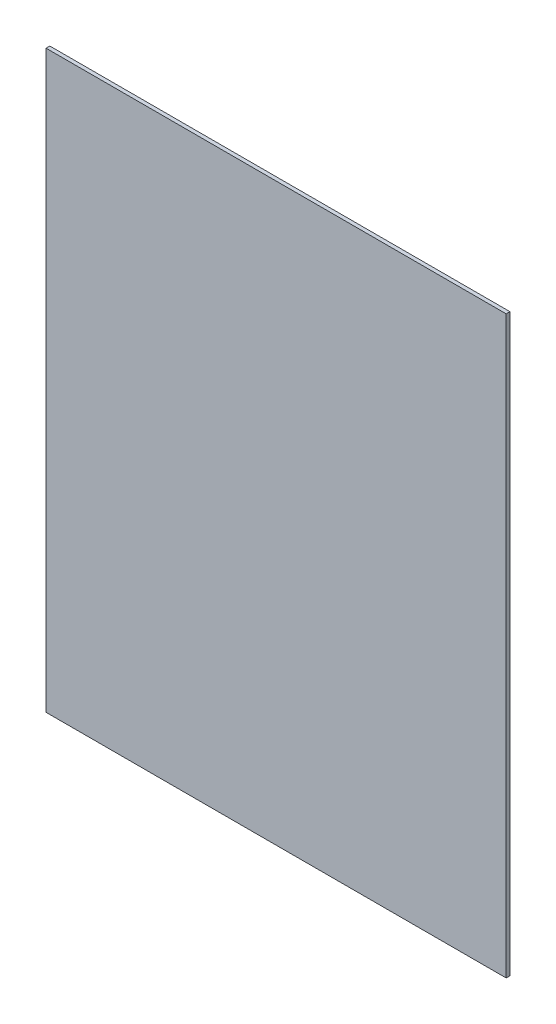
ISO-10303-21;
HEADER;
FILE_DESCRIPTION(('STEP AP214'),'2;1');
FILE_NAME('part.step','',(''),(''),'','','');
FILE_SCHEMA(('AUTOMOTIVE_DESIGN { 1 0 10303 214 1 1 1 1 }'));
ENDSEC;
DATA;
#1=APPLICATION_CONTEXT('core data for automotive mechanical design processes');
#2=APPLICATION_PROTOCOL_DEFINITION('international standard','automotive_design',2000,#1);
#3=PRODUCT_CONTEXT('',#1,'mechanical');
#4=PRODUCT('Part','Part','',(#3));
#5=PRODUCT_RELATED_PRODUCT_CATEGORY('part','',(#4));
#6=PRODUCT_DEFINITION_FORMATION('','',#4);
#7=PRODUCT_DEFINITION_CONTEXT('part definition',#1,'design');
#8=PRODUCT_DEFINITION('design','',#6,#7);
#9=PRODUCT_DEFINITION_SHAPE('','',#8);
#10=(LENGTH_UNIT() NAMED_UNIT(*) SI_UNIT(.MILLI.,.METRE.));
#11=(NAMED_UNIT(*) PLANE_ANGLE_UNIT() SI_UNIT($,.RADIAN.));
#12=(NAMED_UNIT(*) SI_UNIT($,.STERADIAN.) SOLID_ANGLE_UNIT());
#13=UNCERTAINTY_MEASURE_WITH_UNIT(LENGTH_MEASURE(1.E-05),#10,'distance_accuracy_value','');
#14=(GEOMETRIC_REPRESENTATION_CONTEXT(3) GLOBAL_UNCERTAINTY_ASSIGNED_CONTEXT((#13)) GLOBAL_UNIT_ASSIGNED_CONTEXT((#10,
#11,#12)) REPRESENTATION_CONTEXT('',''));
#15=CARTESIAN_POINT('',(0.,0.,0.));
#16=DIRECTION('',(0.,0.,1.));
#17=DIRECTION('',(1.,0.,0.));
#18=AXIS2_PLACEMENT_3D('',#15,#16,#17);
#19=CARTESIAN_POINT('',(-122.,-152.5,2.));
#20=DIRECTION('',(1.,0.,0.));
#21=DIRECTION('',(0.,0.,-1.));
#22=AXIS2_PLACEMENT_3D('',#19,#20,#21);
#23=PLANE('',#22);
#24=DIRECTION('',(0.,-1.,0.));
#25=VECTOR('',#24,1.);
#26=CARTESIAN_POINT('',(-122.,-152.5,0.));
#27=LINE('',#26,#25);
#28=CARTESIAN_POINT('',(-122.,152.5,0.));
#29=VERTEX_POINT('',#28);
#30=CARTESIAN_POINT('',(-122.,-152.5,0.));
#31=VERTEX_POINT('',#30);
#32=EDGE_CURVE('E100',#29,#31,#27,.T.);
#33=ORIENTED_EDGE('',*,*,#32,.T.);
#34=DIRECTION('',(0.,0.,-1.));
#35=VECTOR('',#34,1.);
#36=CARTESIAN_POINT('',(-122.,-152.5,2.));
#37=LINE('',#36,#35);
#38=CARTESIAN_POINT('',(-122.,-152.5,2.));
#39=VERTEX_POINT('',#38);
#40=EDGE_CURVE('E11',#39,#31,#37,.T.);
#41=ORIENTED_EDGE('',*,*,#40,.F.);
#42=DIRECTION('',(0.,-1.,0.));
#43=VECTOR('',#42,1.);
#44=CARTESIAN_POINT('',(-122.,-152.5,2.));
#45=LINE('',#44,#43);
#46=CARTESIAN_POINT('',(-122.,152.5,2.));
#47=VERTEX_POINT('',#46);
#48=EDGE_CURVE('E88',#47,#39,#45,.T.);
#49=ORIENTED_EDGE('',*,*,#48,.F.);
#50=DIRECTION('',(0.,0.,-1.));
#51=VECTOR('',#50,1.);
#52=CARTESIAN_POINT('',(-122.,152.5,2.));
#53=LINE('',#52,#51);
#54=EDGE_CURVE('E96',#47,#29,#53,.T.);
#55=ORIENTED_EDGE('',*,*,#54,.T.);
#56=EDGE_LOOP('',(#33,#41,#49,#55));
#57=FACE_BOUND('',#56,.T.);
#58=ADVANCED_FACE('F37',(#57),#23,.F.);
#59=CARTESIAN_POINT('',(122.,-152.5,2.));
#60=DIRECTION('',(0.,1.,0.));
#61=DIRECTION('',(-1.,0.,0.));
#62=AXIS2_PLACEMENT_3D('',#59,#60,#61);
#63=PLANE('',#62);
#64=DIRECTION('',(1.,0.,0.));
#65=VECTOR('',#64,1.);
#66=CARTESIAN_POINT('',(122.,-152.5,0.));
#67=LINE('',#66,#65);
#68=CARTESIAN_POINT('',(122.,-152.5,0.));
#69=VERTEX_POINT('',#68);
#70=EDGE_CURVE('E92',#31,#69,#67,.T.);
#71=ORIENTED_EDGE('',*,*,#70,.T.);
#72=DIRECTION('',(0.,0.,-1.));
#73=VECTOR('',#72,1.);
#74=CARTESIAN_POINT('',(122.,-152.5,2.));
#75=LINE('',#74,#73);
#76=CARTESIAN_POINT('',(122.,-152.5,2.));
#77=VERTEX_POINT('',#76);
#78=EDGE_CURVE('E45',#77,#69,#75,.T.);
#79=ORIENTED_EDGE('',*,*,#78,.F.);
#80=DIRECTION('',(1.,0.,0.));
#81=VECTOR('',#80,1.);
#82=CARTESIAN_POINT('',(122.,-152.5,2.));
#83=LINE('',#82,#81);
#84=EDGE_CURVE('E83',#39,#77,#83,.T.);
#85=ORIENTED_EDGE('',*,*,#84,.F.);
#86=ORIENTED_EDGE('',*,*,#40,.T.);
#87=EDGE_LOOP('',(#71,#79,#85,#86));
#88=FACE_BOUND('',#87,.T.);
#89=ADVANCED_FACE('F91',(#88),#63,.F.);
#90=CARTESIAN_POINT('',(122.,-152.5,2.));
#91=DIRECTION('',(-1.,0.,0.));
#92=DIRECTION('',(0.,0.,1.));
#93=AXIS2_PLACEMENT_3D('',#90,#91,#92);
#94=PLANE('',#93);
#95=DIRECTION('',(0.,1.,0.));
#96=VECTOR('',#95,1.);
#97=CARTESIAN_POINT('',(122.,-152.5,0.));
#98=LINE('',#97,#96);
#99=CARTESIAN_POINT('',(122.,152.5,0.));
#100=VERTEX_POINT('',#99);
#101=EDGE_CURVE('E70',#69,#100,#98,.T.);
#102=ORIENTED_EDGE('',*,*,#101,.T.);
#103=DIRECTION('',(0.,0.,-1.));
#104=VECTOR('',#103,1.);
#105=CARTESIAN_POINT('',(122.,152.5,2.));
#106=LINE('',#105,#104);
#107=CARTESIAN_POINT('',(122.,152.5,2.));
#108=VERTEX_POINT('',#107);
#109=EDGE_CURVE('E93',#108,#100,#106,.T.);
#110=ORIENTED_EDGE('',*,*,#109,.F.);
#111=DIRECTION('',(0.,1.,0.));
#112=VECTOR('',#111,1.);
#113=CARTESIAN_POINT('',(122.,-152.5,2.));
#114=LINE('',#113,#112);
#115=EDGE_CURVE('E86',#77,#108,#114,.T.);
#116=ORIENTED_EDGE('',*,*,#115,.F.);
#117=ORIENTED_EDGE('',*,*,#78,.T.);
#118=EDGE_LOOP('',(#102,#110,#116,#117));
#119=FACE_BOUND('',#118,.T.);
#120=ADVANCED_FACE('F94',(#119),#94,.F.);
#121=CARTESIAN_POINT('',(122.,152.5,2.));
#122=DIRECTION('',(0.,-1.,0.));
#123=DIRECTION('',(1.,0.,0.));
#124=AXIS2_PLACEMENT_3D('',#121,#122,#123);
#125=PLANE('',#124);
#126=DIRECTION('',(-1.,0.,0.));
#127=VECTOR('',#126,1.);
#128=CARTESIAN_POINT('',(122.,152.5,0.));
#129=LINE('',#128,#127);
#130=EDGE_CURVE('E76',#100,#29,#129,.T.);
#131=ORIENTED_EDGE('',*,*,#130,.T.);
#132=ORIENTED_EDGE('',*,*,#54,.F.);
#133=DIRECTION('',(-1.,0.,0.));
#134=VECTOR('',#133,1.);
#135=CARTESIAN_POINT('',(122.,152.5,2.));
#136=LINE('',#135,#134);
#137=EDGE_CURVE('E53',#108,#47,#136,.T.);
#138=ORIENTED_EDGE('',*,*,#137,.F.);
#139=ORIENTED_EDGE('',*,*,#109,.T.);
#140=EDGE_LOOP('',(#131,#132,#138,#139));
#141=FACE_BOUND('',#140,.T.);
#142=ADVANCED_FACE('F107',(#141),#125,.F.);
#143=CARTESIAN_POINT('',(0.,0.,2.));
#144=DIRECTION('',(0.,0.,1.));
#145=DIRECTION('',(1.,0.,0.));
#146=AXIS2_PLACEMENT_3D('',#143,#144,#145);
#147=PLANE('',#146);
#148=ORIENTED_EDGE('',*,*,#48,.T.);
#149=ORIENTED_EDGE('',*,*,#84,.T.);
#150=ORIENTED_EDGE('',*,*,#115,.T.);
#151=ORIENTED_EDGE('',*,*,#137,.T.);
#152=EDGE_LOOP('',(#148,#149,#150,#151));
#153=FACE_BOUND('',#152,.T.);
#154=ADVANCED_FACE('F84',(#153),#147,.T.);
#155=CARTESIAN_POINT('',(0.,0.,0.));
#156=DIRECTION('',(0.,0.,1.));
#157=DIRECTION('',(1.,0.,0.));
#158=AXIS2_PLACEMENT_3D('',#155,#156,#157);
#159=PLANE('',#158);
#160=ORIENTED_EDGE('',*,*,#32,.F.);
#161=ORIENTED_EDGE('',*,*,#130,.F.);
#162=ORIENTED_EDGE('',*,*,#101,.F.);
#163=ORIENTED_EDGE('',*,*,#70,.F.);
#164=EDGE_LOOP('',(#160,#161,#162,#163));
#165=FACE_BOUND('',#164,.T.);
#166=ADVANCED_FACE('F110',(#165),#159,.F.);
#167=CLOSED_SHELL('',(#58,#89,#120,#142,#154,#166));
#168=MANIFOLD_SOLID_BREP('B2',#167);
#169=ADVANCED_BREP_SHAPE_REPRESENTATION('',(#18,#168),#14);
#170=SHAPE_DEFINITION_REPRESENTATION(#9,#169);
ENDSEC;
END-ISO-10303-21;
